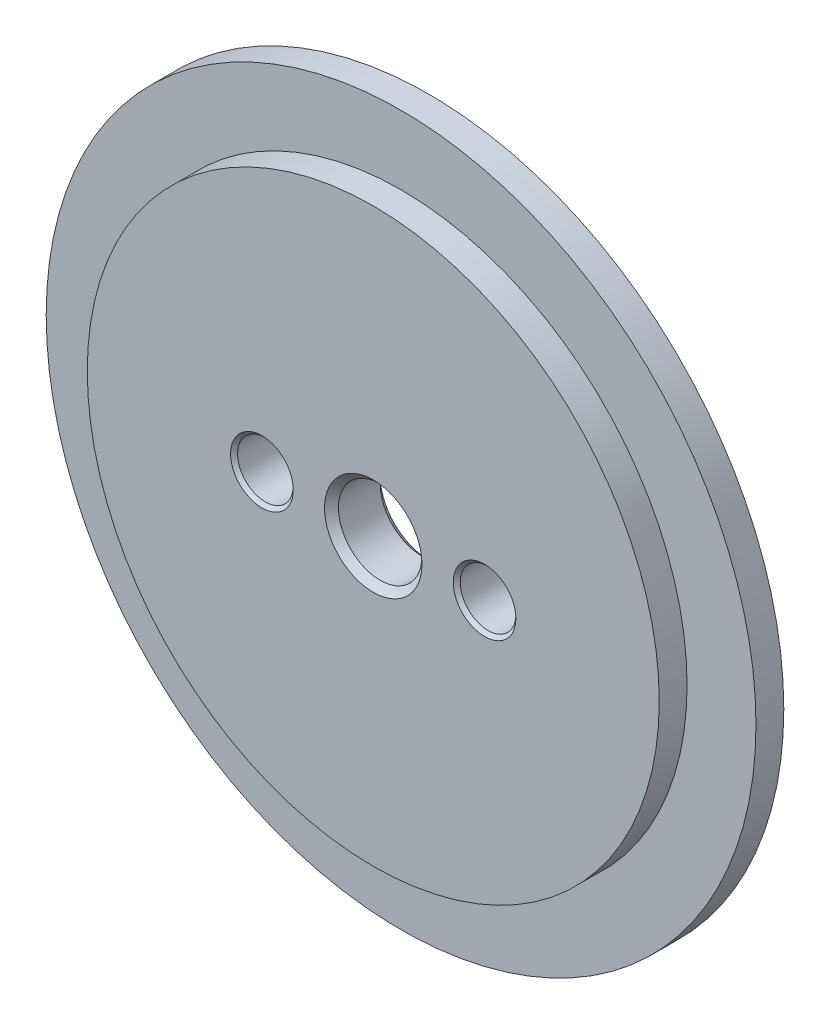
ISO-10303-21;
HEADER;
FILE_DESCRIPTION(('STEP AP214'),'2;1');
FILE_NAME('part.step','',(''),(''),'','','');
FILE_SCHEMA(('AUTOMOTIVE_DESIGN { 1 0 10303 214 1 1 1 1 }'));
ENDSEC;
DATA;
#1=APPLICATION_CONTEXT('core data for automotive mechanical design processes');
#2=APPLICATION_PROTOCOL_DEFINITION('international standard','automotive_design',2000,#1);
#3=PRODUCT_CONTEXT('',#1,'mechanical');
#4=PRODUCT('Part','Part','',(#3));
#5=PRODUCT_RELATED_PRODUCT_CATEGORY('part','',(#4));
#6=PRODUCT_DEFINITION_FORMATION('','',#4);
#7=PRODUCT_DEFINITION_CONTEXT('part definition',#1,'design');
#8=PRODUCT_DEFINITION('design','',#6,#7);
#9=PRODUCT_DEFINITION_SHAPE('','',#8);
#10=(LENGTH_UNIT() NAMED_UNIT(*) SI_UNIT(.MILLI.,.METRE.));
#11=(NAMED_UNIT(*) PLANE_ANGLE_UNIT() SI_UNIT($,.RADIAN.));
#12=(NAMED_UNIT(*) SI_UNIT($,.STERADIAN.) SOLID_ANGLE_UNIT());
#13=UNCERTAINTY_MEASURE_WITH_UNIT(LENGTH_MEASURE(1.E-05),#10,'distance_accuracy_value','');
#14=(GEOMETRIC_REPRESENTATION_CONTEXT(3) GLOBAL_UNCERTAINTY_ASSIGNED_CONTEXT((#13)) GLOBAL_UNIT_ASSIGNED_CONTEXT((#10,
#11,#12)) REPRESENTATION_CONTEXT('',''));
#15=CARTESIAN_POINT('',(0.,0.,0.));
#16=DIRECTION('',(0.,0.,1.));
#17=DIRECTION('',(1.,0.,0.));
#18=AXIS2_PLACEMENT_3D('',#15,#16,#17);
#19=CARTESIAN_POINT('',(0.,0.,2.));
#20=DIRECTION('',(0.,0.,-1.));
#21=DIRECTION('',(-1.,0.,0.));
#22=AXIS2_PLACEMENT_3D('',#19,#20,#21);
#23=CYLINDRICAL_SURFACE('',#22,25.5);
#24=CARTESIAN_POINT('',(0.,0.,2.));
#25=DIRECTION('',(0.,0.,1.));
#26=DIRECTION('',(1.,0.,0.));
#27=AXIS2_PLACEMENT_3D('',#24,#25,#26);
#28=CIRCLE('',#27,25.5);
#29=CARTESIAN_POINT('',(25.5,0.,2.));
#30=VERTEX_POINT('',#29);
#31=EDGE_CURVE('E100',#30,#30,#28,.T.);
#32=ORIENTED_EDGE('',*,*,#31,.F.);
#33=EDGE_LOOP('',(#32));
#34=FACE_BOUND('',#33,.T.);
#35=CARTESIAN_POINT('',(0.,0.,0.));
#36=DIRECTION('',(0.,0.,1.));
#37=DIRECTION('',(1.,0.,0.));
#38=AXIS2_PLACEMENT_3D('',#35,#36,#37);
#39=CIRCLE('',#38,25.5);
#40=CARTESIAN_POINT('',(25.5,0.,0.));
#41=VERTEX_POINT('',#40);
#42=EDGE_CURVE('E96',#41,#41,#39,.T.);
#43=ORIENTED_EDGE('',*,*,#42,.T.);
#44=EDGE_LOOP('',(#43));
#45=FACE_BOUND('',#44,.T.);
#46=ADVANCED_FACE('F38',(#34,#45),#23,.T.);
#47=CARTESIAN_POINT('',(0.,0.,2.));
#48=DIRECTION('',(0.,0.,1.));
#49=DIRECTION('',(1.,0.,0.));
#50=AXIS2_PLACEMENT_3D('',#47,#48,#49);
#51=PLANE('',#50);
#52=CARTESIAN_POINT('',(0.,0.,2.));
#53=DIRECTION('',(0.,0.,1.));
#54=DIRECTION('',(1.,0.,0.));
#55=AXIS2_PLACEMENT_3D('',#52,#53,#54);
#56=CIRCLE('',#55,20.55);
#57=CARTESIAN_POINT('',(20.55,0.,2.));
#58=VERTEX_POINT('',#57);
#59=EDGE_CURVE('E95',#58,#58,#56,.T.);
#60=ORIENTED_EDGE('',*,*,#59,.F.);
#61=EDGE_LOOP('',(#60));
#62=FACE_BOUND('',#61,.T.);
#63=ORIENTED_EDGE('',*,*,#31,.T.);
#64=EDGE_LOOP('',(#63));
#65=FACE_BOUND('',#64,.T.);
#66=ADVANCED_FACE('F121',(#62,#65),#51,.T.);
#67=CARTESIAN_POINT('',(0.,0.,0.));
#68=DIRECTION('',(0.,0.,1.));
#69=DIRECTION('',(1.,0.,0.));
#70=AXIS2_PLACEMENT_3D('',#67,#68,#69);
#71=PLANE('',#70);
#72=CARTESIAN_POINT('',(0.,0.,0.));
#73=DIRECTION('',(0.,0.,1.));
#74=DIRECTION('',(1.,0.,0.));
#75=AXIS2_PLACEMENT_3D('',#72,#73,#74);
#76=CIRCLE('',#75,3.49999999999999);
#77=CARTESIAN_POINT('',(3.49999999999999,0.,0.));
#78=VERTEX_POINT('',#77);
#79=EDGE_CURVE('E47',#78,#78,#76,.T.);
#80=ORIENTED_EDGE('',*,*,#79,.T.);
#81=EDGE_LOOP('',(#80));
#82=FACE_BOUND('',#81,.T.);
#83=CARTESIAN_POINT('',(-8.,0.,0.));
#84=DIRECTION('',(0.,0.,1.));
#85=DIRECTION('',(1.,0.,0.));
#86=AXIS2_PLACEMENT_3D('',#83,#84,#85);
#87=CIRCLE('',#86,2.25);
#88=CARTESIAN_POINT('',(-5.75,0.,0.));
#89=VERTEX_POINT('',#88);
#90=EDGE_CURVE('E67',#89,#89,#87,.T.);
#91=ORIENTED_EDGE('',*,*,#90,.T.);
#92=EDGE_LOOP('',(#91));
#93=FACE_BOUND('',#92,.T.);
#94=CARTESIAN_POINT('',(8.,0.,0.));
#95=DIRECTION('',(0.,0.,1.));
#96=DIRECTION('',(1.,0.,0.));
#97=AXIS2_PLACEMENT_3D('',#94,#95,#96);
#98=CIRCLE('',#97,2.25000000000001);
#99=CARTESIAN_POINT('',(10.25,0.,0.));
#100=VERTEX_POINT('',#99);
#101=EDGE_CURVE('E83',#100,#100,#98,.T.);
#102=ORIENTED_EDGE('',*,*,#101,.T.);
#103=EDGE_LOOP('',(#102));
#104=FACE_BOUND('',#103,.T.);
#105=ORIENTED_EDGE('',*,*,#42,.F.);
#106=EDGE_LOOP('',(#105));
#107=FACE_BOUND('',#106,.T.);
#108=ADVANCED_FACE('F117',(#82,#93,#104,#107),#71,.F.);
#109=CARTESIAN_POINT('',(0.,0.,4.));
#110=DIRECTION('',(0.,0.,-1.));
#111=DIRECTION('',(-1.,0.,0.));
#112=AXIS2_PLACEMENT_3D('',#109,#110,#111);
#113=CYLINDRICAL_SURFACE('',#112,20.55);
#114=CARTESIAN_POINT('',(0.,0.,4.));
#115=DIRECTION('',(0.,0.,1.));
#116=DIRECTION('',(1.,0.,0.));
#117=AXIS2_PLACEMENT_3D('',#114,#115,#116);
#118=CIRCLE('',#117,20.55);
#119=CARTESIAN_POINT('',(20.55,0.,4.));
#120=VERTEX_POINT('',#119);
#121=EDGE_CURVE('E101',#120,#120,#118,.T.);
#122=ORIENTED_EDGE('',*,*,#121,.F.);
#123=EDGE_LOOP('',(#122));
#124=FACE_BOUND('',#123,.T.);
#125=ORIENTED_EDGE('',*,*,#59,.T.);
#126=EDGE_LOOP('',(#125));
#127=FACE_BOUND('',#126,.T.);
#128=ADVANCED_FACE('F114',(#124,#127),#113,.T.);
#129=CARTESIAN_POINT('',(0.,0.,4.));
#130=DIRECTION('',(0.,0.,1.));
#131=DIRECTION('',(1.,0.,0.));
#132=AXIS2_PLACEMENT_3D('',#129,#130,#131);
#133=PLANE('',#132);
#134=CARTESIAN_POINT('',(0.,0.,4.));
#135=DIRECTION('',(0.,0.,1.));
#136=DIRECTION('',(1.,0.,0.));
#137=AXIS2_PLACEMENT_3D('',#134,#135,#136);
#138=CIRCLE('',#137,3.50000000000002);
#139=CARTESIAN_POINT('',(3.50000000000002,0.,4.));
#140=VERTEX_POINT('',#139);
#141=EDGE_CURVE('E10',#140,#140,#138,.F.);
#142=ORIENTED_EDGE('',*,*,#141,.T.);
#143=EDGE_LOOP('',(#142));
#144=FACE_BOUND('',#143,.T.);
#145=CARTESIAN_POINT('',(-8.,0.,4.));
#146=DIRECTION('',(0.,0.,1.));
#147=DIRECTION('',(1.,0.,0.));
#148=AXIS2_PLACEMENT_3D('',#145,#146,#147);
#149=CIRCLE('',#148,2.25000000000002);
#150=CARTESIAN_POINT('',(-5.74999999999998,0.,4.));
#151=VERTEX_POINT('',#150);
#152=EDGE_CURVE('E63',#151,#151,#149,.F.);
#153=ORIENTED_EDGE('',*,*,#152,.T.);
#154=EDGE_LOOP('',(#153));
#155=FACE_BOUND('',#154,.T.);
#156=CARTESIAN_POINT('',(8.,0.,4.));
#157=DIRECTION('',(0.,0.,1.));
#158=DIRECTION('',(1.,0.,0.));
#159=AXIS2_PLACEMENT_3D('',#156,#157,#158);
#160=CIRCLE('',#159,2.25000000000001);
#161=CARTESIAN_POINT('',(10.25,0.,4.));
#162=VERTEX_POINT('',#161);
#163=EDGE_CURVE('E79',#162,#162,#160,.F.);
#164=ORIENTED_EDGE('',*,*,#163,.T.);
#165=EDGE_LOOP('',(#164));
#166=FACE_BOUND('',#165,.T.);
#167=ORIENTED_EDGE('',*,*,#121,.T.);
#168=EDGE_LOOP('',(#167));
#169=FACE_BOUND('',#168,.T.);
#170=ADVANCED_FACE('F112',(#144,#155,#166,#169),#133,.T.);
#171=CARTESIAN_POINT('',(0.,0.,4.));
#172=DIRECTION('',(0.,0.,-1.));
#173=DIRECTION('',(-1.,0.,0.));
#174=AXIS2_PLACEMENT_3D('',#171,#172,#173);
#175=CYLINDRICAL_SURFACE('',#174,3.);
#176=CARTESIAN_POINT('',(0.,0.,0.499999999999993));
#177=DIRECTION('',(0.,0.,1.));
#178=DIRECTION('',(1.,0.,0.));
#179=AXIS2_PLACEMENT_3D('',#176,#177,#178);
#180=CIRCLE('',#179,3.);
#181=CARTESIAN_POINT('',(3.,0.,0.499999999999993));
#182=VERTEX_POINT('',#181);
#183=EDGE_CURVE('E52',#182,#182,#180,.F.);
#184=ORIENTED_EDGE('',*,*,#183,.T.);
#185=EDGE_LOOP('',(#184));
#186=FACE_BOUND('',#185,.T.);
#187=CARTESIAN_POINT('',(0.,0.,3.49999999999999));
#188=DIRECTION('',(0.,0.,1.));
#189=DIRECTION('',(1.,0.,0.));
#190=AXIS2_PLACEMENT_3D('',#187,#188,#189);
#191=CIRCLE('',#190,3.);
#192=CARTESIAN_POINT('',(3.,0.,3.49999999999999));
#193=VERTEX_POINT('',#192);
#194=EDGE_CURVE('E57',#193,#193,#191,.T.);
#195=ORIENTED_EDGE('',*,*,#194,.T.);
#196=EDGE_LOOP('',(#195));
#197=FACE_BOUND('',#196,.T.);
#198=ADVANCED_FACE('F181',(#186,#197),#175,.F.);
#199=CARTESIAN_POINT('',(-8.,0.,4.));
#200=DIRECTION('',(0.,0.,-1.));
#201=DIRECTION('',(-1.,0.,0.));
#202=AXIS2_PLACEMENT_3D('',#199,#200,#201);
#203=CYLINDRICAL_SURFACE('',#202,2.);
#204=CARTESIAN_POINT('',(-8.,0.,0.250000000000009));
#205=DIRECTION('',(0.,0.,1.));
#206=DIRECTION('',(1.,0.,0.));
#207=AXIS2_PLACEMENT_3D('',#204,#205,#206);
#208=CIRCLE('',#207,2.);
#209=CARTESIAN_POINT('',(-6.,0.,0.250000000000009));
#210=VERTEX_POINT('',#209);
#211=EDGE_CURVE('E71',#210,#210,#208,.F.);
#212=ORIENTED_EDGE('',*,*,#211,.T.);
#213=EDGE_LOOP('',(#212));
#214=FACE_BOUND('',#213,.T.);
#215=CARTESIAN_POINT('',(-8.,0.,3.74999999999998));
#216=DIRECTION('',(0.,0.,1.));
#217=DIRECTION('',(1.,0.,0.));
#218=AXIS2_PLACEMENT_3D('',#215,#216,#217);
#219=CIRCLE('',#218,2.);
#220=CARTESIAN_POINT('',(-6.,0.,3.74999999999998));
#221=VERTEX_POINT('',#220);
#222=EDGE_CURVE('E75',#221,#221,#219,.T.);
#223=ORIENTED_EDGE('',*,*,#222,.T.);
#224=EDGE_LOOP('',(#223));
#225=FACE_BOUND('',#224,.T.);
#226=ADVANCED_FACE('F184',(#214,#225),#203,.F.);
#227=CARTESIAN_POINT('',(8.,0.,4.));
#228=DIRECTION('',(0.,0.,-1.));
#229=DIRECTION('',(-1.,0.,0.));
#230=AXIS2_PLACEMENT_3D('',#227,#228,#229);
#231=CYLINDRICAL_SURFACE('',#230,2.);
#232=CARTESIAN_POINT('',(8.,0.,0.250000000000008));
#233=DIRECTION('',(0.,0.,1.));
#234=DIRECTION('',(1.,0.,0.));
#235=AXIS2_PLACEMENT_3D('',#232,#233,#234);
#236=CIRCLE('',#235,2.);
#237=CARTESIAN_POINT('',(10.,0.,0.250000000000008));
#238=VERTEX_POINT('',#237);
#239=EDGE_CURVE('E87',#238,#238,#236,.F.);
#240=ORIENTED_EDGE('',*,*,#239,.T.);
#241=EDGE_LOOP('',(#240));
#242=FACE_BOUND('',#241,.T.);
#243=CARTESIAN_POINT('',(8.,0.,3.75));
#244=DIRECTION('',(0.,0.,1.));
#245=DIRECTION('',(1.,0.,0.));
#246=AXIS2_PLACEMENT_3D('',#243,#244,#245);
#247=CIRCLE('',#246,2.);
#248=CARTESIAN_POINT('',(10.,0.,3.75));
#249=VERTEX_POINT('',#248);
#250=EDGE_CURVE('E91',#249,#249,#247,.T.);
#251=ORIENTED_EDGE('',*,*,#250,.T.);
#252=EDGE_LOOP('',(#251));
#253=FACE_BOUND('',#252,.T.);
#254=ADVANCED_FACE('F148',(#242,#253),#231,.F.);
#255=CARTESIAN_POINT('',(8.,0.,0.250000000000008));
#256=DIRECTION('',(0.,0.,-1.));
#257=DIRECTION('',(-1.,0.,0.));
#258=AXIS2_PLACEMENT_3D('',#255,#256,#257);
#259=CONICAL_SURFACE('',#258,2.,0.785398163397448);
#260=ORIENTED_EDGE('',*,*,#101,.F.);
#261=EDGE_LOOP('',(#260));
#262=FACE_BOUND('',#261,.T.);
#263=ORIENTED_EDGE('',*,*,#239,.F.);
#264=EDGE_LOOP('',(#263));
#265=FACE_BOUND('',#264,.T.);
#266=ADVANCED_FACE('F141',(#262,#265),#259,.F.);
#267=CARTESIAN_POINT('',(8.,0.,4.));
#268=DIRECTION('',(0.,0.,1.));
#269=DIRECTION('',(1.,0.,0.));
#270=AXIS2_PLACEMENT_3D('',#267,#268,#269);
#271=CONICAL_SURFACE('',#270,2.25000000000001,0.785398163397462);
#272=ORIENTED_EDGE('',*,*,#250,.F.);
#273=EDGE_LOOP('',(#272));
#274=FACE_BOUND('',#273,.T.);
#275=ORIENTED_EDGE('',*,*,#163,.F.);
#276=EDGE_LOOP('',(#275));
#277=FACE_BOUND('',#276,.T.);
#278=ADVANCED_FACE('F147',(#274,#277),#271,.F.);
#279=CARTESIAN_POINT('',(-8.,0.,0.250000000000009));
#280=DIRECTION('',(0.,0.,-1.));
#281=DIRECTION('',(-1.,0.,0.));
#282=AXIS2_PLACEMENT_3D('',#279,#280,#281);
#283=CONICAL_SURFACE('',#282,2.,0.785398163397434);
#284=ORIENTED_EDGE('',*,*,#90,.F.);
#285=EDGE_LOOP('',(#284));
#286=FACE_BOUND('',#285,.T.);
#287=ORIENTED_EDGE('',*,*,#211,.F.);
#288=EDGE_LOOP('',(#287));
#289=FACE_BOUND('',#288,.T.);
#290=ADVANCED_FACE('F155',(#286,#289),#283,.F.);
#291=CARTESIAN_POINT('',(-8.,0.,4.));
#292=DIRECTION('',(0.,0.,1.));
#293=DIRECTION('',(1.,0.,0.));
#294=AXIS2_PLACEMENT_3D('',#291,#292,#293);
#295=CONICAL_SURFACE('',#294,2.25000000000002,0.785398163397448);
#296=ORIENTED_EDGE('',*,*,#222,.F.);
#297=EDGE_LOOP('',(#296));
#298=FACE_BOUND('',#297,.T.);
#299=ORIENTED_EDGE('',*,*,#152,.F.);
#300=EDGE_LOOP('',(#299));
#301=FACE_BOUND('',#300,.T.);
#302=ADVANCED_FACE('F162',(#298,#301),#295,.F.);
#303=CARTESIAN_POINT('',(0.,0.,0.499999999999993));
#304=DIRECTION('',(0.,0.,-1.));
#305=DIRECTION('',(-1.,0.,0.));
#306=AXIS2_PLACEMENT_3D('',#303,#304,#305);
#307=CONICAL_SURFACE('',#306,3.,0.785398163397445);
#308=ORIENTED_EDGE('',*,*,#79,.F.);
#309=EDGE_LOOP('',(#308));
#310=FACE_BOUND('',#309,.T.);
#311=ORIENTED_EDGE('',*,*,#183,.F.);
#312=EDGE_LOOP('',(#311));
#313=FACE_BOUND('',#312,.T.);
#314=ADVANCED_FACE('F168',(#310,#313),#307,.F.);
#315=CARTESIAN_POINT('',(0.,0.,4.));
#316=DIRECTION('',(0.,0.,1.));
#317=DIRECTION('',(1.,0.,0.));
#318=AXIS2_PLACEMENT_3D('',#315,#316,#317);
#319=CONICAL_SURFACE('',#318,3.50000000000002,0.785398163397459);
#320=ORIENTED_EDGE('',*,*,#194,.F.);
#321=EDGE_LOOP('',(#320));
#322=FACE_BOUND('',#321,.T.);
#323=ORIENTED_EDGE('',*,*,#141,.F.);
#324=EDGE_LOOP('',(#323));
#325=FACE_BOUND('',#324,.T.);
#326=ADVANCED_FACE('F41',(#322,#325),#319,.F.);
#327=CLOSED_SHELL('',(#46,#66,#108,#128,#170,#198,#226,#254,#266,#278,#290,#302,#314,#326));
#328=MANIFOLD_SOLID_BREP('B2',#327);
#329=ADVANCED_BREP_SHAPE_REPRESENTATION('',(#18,#328),#14);
#330=SHAPE_DEFINITION_REPRESENTATION(#9,#329);
ENDSEC;
END-ISO-10303-21;
